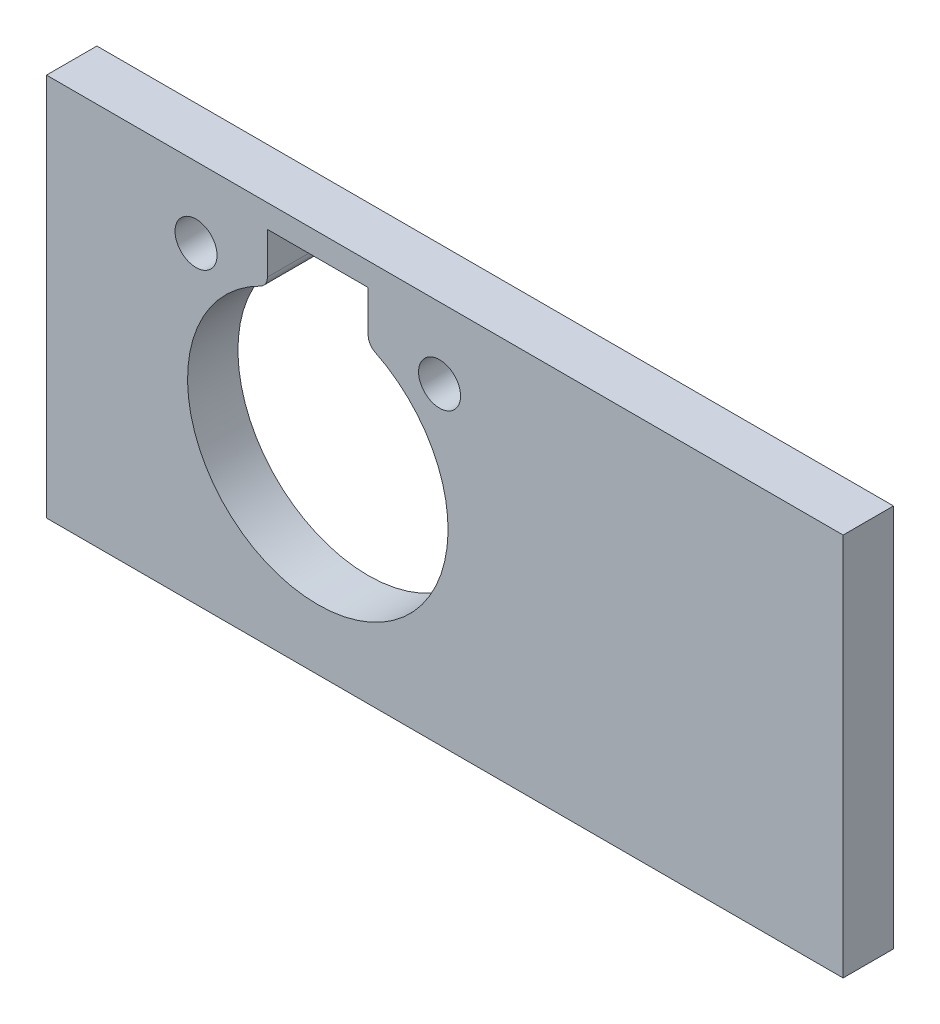
ISO-10303-21;
HEADER;
FILE_DESCRIPTION(('STEP AP214'),'2;1');
FILE_NAME('part.step','',(''),(''),'','','');
FILE_SCHEMA(('AUTOMOTIVE_DESIGN { 1 0 10303 214 1 1 1 1 }'));
ENDSEC;
DATA;
#1=APPLICATION_CONTEXT('core data for automotive mechanical design processes');
#2=APPLICATION_PROTOCOL_DEFINITION('international standard','automotive_design',2000,#1);
#3=PRODUCT_CONTEXT('',#1,'mechanical');
#4=PRODUCT('Part','Part','',(#3));
#5=PRODUCT_RELATED_PRODUCT_CATEGORY('part','',(#4));
#6=PRODUCT_DEFINITION_FORMATION('','',#4);
#7=PRODUCT_DEFINITION_CONTEXT('part definition',#1,'design');
#8=PRODUCT_DEFINITION('design','',#6,#7);
#9=PRODUCT_DEFINITION_SHAPE('','',#8);
#10=(LENGTH_UNIT() NAMED_UNIT(*) SI_UNIT(.MILLI.,.METRE.));
#11=(NAMED_UNIT(*) PLANE_ANGLE_UNIT() SI_UNIT($,.RADIAN.));
#12=(NAMED_UNIT(*) SI_UNIT($,.STERADIAN.) SOLID_ANGLE_UNIT());
#13=UNCERTAINTY_MEASURE_WITH_UNIT(LENGTH_MEASURE(1.E-05),#10,'distance_accuracy_value','');
#14=(GEOMETRIC_REPRESENTATION_CONTEXT(3) GLOBAL_UNCERTAINTY_ASSIGNED_CONTEXT((#13)) GLOBAL_UNIT_ASSIGNED_CONTEXT((#10,
#11,#12)) REPRESENTATION_CONTEXT('',''));
#15=CARTESIAN_POINT('',(0.,0.,0.));
#16=DIRECTION('',(0.,0.,1.));
#17=DIRECTION('',(1.,0.,0.));
#18=AXIS2_PLACEMENT_3D('',#15,#16,#17);
#19=CARTESIAN_POINT('',(24.6048030456819,16.0472978945954,3.));
#20=DIRECTION('',(-1.,0.,0.));
#21=DIRECTION('',(0.,-1.,0.));
#22=AXIS2_PLACEMENT_3D('',#19,#20,#21);
#23=PLANE('',#22);
#24=DIRECTION('',(0.,1.,0.));
#25=VECTOR('',#24,1.);
#26=CARTESIAN_POINT('',(24.6048030456819,16.0472978945954,0.));
#27=LINE('',#26,#25);
#28=CARTESIAN_POINT('',(24.6048030456819,-6.79270210540461,0.));
#29=VERTEX_POINT('',#28);
#30=CARTESIAN_POINT('',(24.6048030456819,16.0472978945954,0.));
#31=VERTEX_POINT('',#30);
#32=EDGE_CURVE('E164',#29,#31,#27,.T.);
#33=ORIENTED_EDGE('',*,*,#32,.T.);
#34=DIRECTION('',(0.,0.,-1.));
#35=VECTOR('',#34,1.);
#36=CARTESIAN_POINT('',(24.6048030456819,16.0472978945954,3.));
#37=LINE('',#36,#35);
#38=CARTESIAN_POINT('',(24.6048030456819,16.0472978945954,3.));
#39=VERTEX_POINT('',#38);
#40=EDGE_CURVE('E11',#39,#31,#37,.T.);
#41=ORIENTED_EDGE('',*,*,#40,.F.);
#42=DIRECTION('',(0.,1.,0.));
#43=VECTOR('',#42,1.);
#44=CARTESIAN_POINT('',(24.6048030456819,16.0472978945954,3.));
#45=LINE('',#44,#43);
#46=CARTESIAN_POINT('',(24.6048030456819,-6.79270210540461,3.));
#47=VERTEX_POINT('',#46);
#48=EDGE_CURVE('E165',#47,#39,#45,.T.);
#49=ORIENTED_EDGE('',*,*,#48,.F.);
#50=DIRECTION('',(0.,0.,-1.));
#51=VECTOR('',#50,1.);
#52=CARTESIAN_POINT('',(24.6048030456819,-6.79270210540461,3.));
#53=LINE('',#52,#51);
#54=EDGE_CURVE('E175',#47,#29,#53,.T.);
#55=ORIENTED_EDGE('',*,*,#54,.T.);
#56=EDGE_LOOP('',(#33,#41,#49,#55));
#57=FACE_BOUND('',#56,.T.);
#58=ADVANCED_FACE('F34',(#57),#23,.F.);
#59=CARTESIAN_POINT('',(24.6048030456819,16.0472978945954,3.));
#60=DIRECTION('',(0.,-1.,0.));
#61=DIRECTION('',(1.,0.,0.));
#62=AXIS2_PLACEMENT_3D('',#59,#60,#61);
#63=PLANE('',#62);
#64=DIRECTION('',(-1.,0.,0.));
#65=VECTOR('',#64,1.);
#66=CARTESIAN_POINT('',(24.6048030456819,16.0472978945954,0.));
#67=LINE('',#66,#65);
#68=CARTESIAN_POINT('',(-22.8242074927954,16.0472978945954,0.));
#69=VERTEX_POINT('',#68);
#70=EDGE_CURVE('E178',#31,#69,#67,.T.);
#71=ORIENTED_EDGE('',*,*,#70,.T.);
#72=DIRECTION('',(0.,0.,-1.));
#73=VECTOR('',#72,1.);
#74=CARTESIAN_POINT('',(-22.8242074927954,16.0472978945954,3.));
#75=LINE('',#74,#73);
#76=CARTESIAN_POINT('',(-22.8242074927954,16.0472978945954,3.));
#77=VERTEX_POINT('',#76);
#78=EDGE_CURVE('E41',#77,#69,#75,.T.);
#79=ORIENTED_EDGE('',*,*,#78,.F.);
#80=DIRECTION('',(-1.,0.,0.));
#81=VECTOR('',#80,1.);
#82=CARTESIAN_POINT('',(24.6048030456819,16.0472978945954,3.));
#83=LINE('',#82,#81);
#84=EDGE_CURVE('E168',#39,#77,#83,.T.);
#85=ORIENTED_EDGE('',*,*,#84,.F.);
#86=ORIENTED_EDGE('',*,*,#40,.T.);
#87=EDGE_LOOP('',(#71,#79,#85,#86));
#88=FACE_BOUND('',#87,.T.);
#89=ADVANCED_FACE('F207',(#88),#63,.F.);
#90=CARTESIAN_POINT('',(-22.8242074927954,16.0472978945954,3.));
#91=DIRECTION('',(1.,0.,0.));
#92=DIRECTION('',(0.,1.,0.));
#93=AXIS2_PLACEMENT_3D('',#90,#91,#92);
#94=PLANE('',#93);
#95=DIRECTION('',(0.,-1.,0.));
#96=VECTOR('',#95,1.);
#97=CARTESIAN_POINT('',(-22.8242074927954,16.0472978945954,0.));
#98=LINE('',#97,#96);
#99=CARTESIAN_POINT('',(-22.8242074927954,-6.79270210540462,0.));
#100=VERTEX_POINT('',#99);
#101=EDGE_CURVE('E180',#69,#100,#98,.T.);
#102=ORIENTED_EDGE('',*,*,#101,.T.);
#103=DIRECTION('',(0.,0.,-1.));
#104=VECTOR('',#103,1.);
#105=CARTESIAN_POINT('',(-22.8242074927954,-6.79270210540462,3.));
#106=LINE('',#105,#104);
#107=CARTESIAN_POINT('',(-22.8242074927954,-6.79270210540462,3.));
#108=VERTEX_POINT('',#107);
#109=EDGE_CURVE('E185',#108,#100,#106,.T.);
#110=ORIENTED_EDGE('',*,*,#109,.F.);
#111=DIRECTION('',(0.,-1.,0.));
#112=VECTOR('',#111,1.);
#113=CARTESIAN_POINT('',(-22.8242074927954,16.0472978945954,3.));
#114=LINE('',#113,#112);
#115=EDGE_CURVE('E171',#77,#108,#114,.T.);
#116=ORIENTED_EDGE('',*,*,#115,.F.);
#117=ORIENTED_EDGE('',*,*,#78,.T.);
#118=EDGE_LOOP('',(#102,#110,#116,#117));
#119=FACE_BOUND('',#118,.T.);
#120=ADVANCED_FACE('F192',(#119),#94,.F.);
#121=CARTESIAN_POINT('',(24.6048030456819,-6.79270210540461,3.));
#122=DIRECTION('',(0.,1.,0.));
#123=DIRECTION('',(-1.,0.,0.));
#124=AXIS2_PLACEMENT_3D('',#121,#122,#123);
#125=PLANE('',#124);
#126=DIRECTION('',(1.,0.,0.));
#127=VECTOR('',#126,1.);
#128=CARTESIAN_POINT('',(24.6048030456819,-6.79270210540461,0.));
#129=LINE('',#128,#127);
#130=EDGE_CURVE('E169',#100,#29,#129,.T.);
#131=ORIENTED_EDGE('',*,*,#130,.T.);
#132=ORIENTED_EDGE('',*,*,#54,.F.);
#133=DIRECTION('',(1.,0.,0.));
#134=VECTOR('',#133,1.);
#135=CARTESIAN_POINT('',(24.6048030456819,-6.79270210540461,3.));
#136=LINE('',#135,#134);
#137=EDGE_CURVE('E173',#108,#47,#136,.T.);
#138=ORIENTED_EDGE('',*,*,#137,.F.);
#139=ORIENTED_EDGE('',*,*,#109,.T.);
#140=EDGE_LOOP('',(#131,#132,#138,#139));
#141=FACE_BOUND('',#140,.T.);
#142=ADVANCED_FACE('F200',(#141),#125,.F.);
#143=CARTESIAN_POINT('',(0.,0.,3.));
#144=DIRECTION('',(0.,0.,-1.));
#145=DIRECTION('',(-1.,0.,0.));
#146=AXIS2_PLACEMENT_3D('',#143,#144,#145);
#147=PLANE('',#146);
#148=DIRECTION('',(-1.,0.,0.));
#149=VECTOR('',#148,1.);
#150=CARTESIAN_POINT('',(-3.67180383185212,14.6697978945954,3.));
#151=LINE('',#150,#149);
#152=CARTESIAN_POINT('',(-3.67180383185212,14.6697978945954,3.));
#153=VERTEX_POINT('',#152);
#154=CARTESIAN_POINT('',(-9.67078034036049,14.6697978945954,3.));
#155=VERTEX_POINT('',#154);
#156=EDGE_CURVE('E252',#153,#155,#151,.T.);
#157=ORIENTED_EDGE('',*,*,#156,.F.);
#158=DIRECTION('',(0.,1.,0.));
#159=VECTOR('',#158,1.);
#160=CARTESIAN_POINT('',(-3.67180383185212,14.6697978945954,3.));
#161=LINE('',#160,#159);
#162=CARTESIAN_POINT('',(-3.67180383185212,12.2086935469612,3.));
#163=VERTEX_POINT('',#162);
#164=EDGE_CURVE('E152',#163,#153,#161,.T.);
#165=ORIENTED_EDGE('',*,*,#164,.F.);
#166=CARTESIAN_POINT('',(-2.92180383185212,12.2086935469612,3.));
#167=DIRECTION('',(0.,0.,-1.));
#168=DIRECTION('',(-1.,0.,0.));
#169=AXIS2_PLACEMENT_3D('',#166,#167,#168);
#170=CIRCLE('',#169,0.75);
#171=CARTESIAN_POINT('',(-3.25244653504914,11.5355105088337,3.));
#172=VERTEX_POINT('',#171);
#173=EDGE_CURVE('E149',#172,#163,#170,.T.);
#174=ORIENTED_EDGE('',*,*,#173,.F.);
#175=CARTESIAN_POINT('',(-6.6712920861063,4.57479789459538,3.));
#176=DIRECTION('',(0.,0.,-1.));
#177=DIRECTION('',(-1.,0.,0.));
#178=AXIS2_PLACEMENT_3D('',#175,#176,#177);
#179=CIRCLE('',#178,7.755);
#180=CARTESIAN_POINT('',(-10.0901376371635,11.5355105088337,3.));
#181=VERTEX_POINT('',#180);
#182=EDGE_CURVE('E116',#181,#172,#179,.F.);
#183=ORIENTED_EDGE('',*,*,#182,.F.);
#184=CARTESIAN_POINT('',(-10.4207803403605,12.2086935469612,3.));
#185=DIRECTION('',(0.,0.,-1.));
#186=DIRECTION('',(-1.,0.,0.));
#187=AXIS2_PLACEMENT_3D('',#184,#185,#186);
#188=CIRCLE('',#187,0.749999999999999);
#189=CARTESIAN_POINT('',(-9.67078034036049,12.2086935469612,3.));
#190=VERTEX_POINT('',#189);
#191=EDGE_CURVE('E262',#190,#181,#188,.T.);
#192=ORIENTED_EDGE('',*,*,#191,.F.);
#193=DIRECTION('',(0.,-1.,0.));
#194=VECTOR('',#193,1.);
#195=CARTESIAN_POINT('',(-9.67078034036049,12.2086935469612,3.));
#196=LINE('',#195,#194);
#197=EDGE_CURVE('E256',#155,#190,#196,.T.);
#198=ORIENTED_EDGE('',*,*,#197,.F.);
#199=EDGE_LOOP('',(#157,#165,#174,#183,#192,#198));
#200=FACE_BOUND('',#199,.T.);
#201=CARTESIAN_POINT('',(-13.9212920861063,11.8247978945954,3.));
#202=DIRECTION('',(0.,0.,-1.));
#203=DIRECTION('',(-1.,0.,0.));
#204=AXIS2_PLACEMENT_3D('',#201,#202,#203);
#205=CIRCLE('',#204,1.25000000000045);
#206=CARTESIAN_POINT('',(-15.1712920861068,11.8247978945954,3.));
#207=VERTEX_POINT('',#206);
#208=EDGE_CURVE('E155',#207,#207,#205,.F.);
#209=ORIENTED_EDGE('',*,*,#208,.F.);
#210=EDGE_LOOP('',(#209));
#211=FACE_BOUND('',#210,.T.);
#212=CARTESIAN_POINT('',(0.578707913893695,11.8247978945954,3.));
#213=DIRECTION('',(0.,0.,-1.));
#214=DIRECTION('',(-1.,0.,0.));
#215=AXIS2_PLACEMENT_3D('',#212,#213,#214);
#216=CIRCLE('',#215,1.25000000000045);
#217=CARTESIAN_POINT('',(-0.671292086106753,11.8247978945954,3.));
#218=VERTEX_POINT('',#217);
#219=EDGE_CURVE('E161',#218,#218,#216,.F.);
#220=ORIENTED_EDGE('',*,*,#219,.F.);
#221=EDGE_LOOP('',(#220));
#222=FACE_BOUND('',#221,.T.);
#223=ORIENTED_EDGE('',*,*,#48,.T.);
#224=ORIENTED_EDGE('',*,*,#84,.T.);
#225=ORIENTED_EDGE('',*,*,#115,.T.);
#226=ORIENTED_EDGE('',*,*,#137,.T.);
#227=EDGE_LOOP('',(#223,#224,#225,#226));
#228=FACE_BOUND('',#227,.T.);
#229=ADVANCED_FACE('F206',(#200,#211,#222,#228),#147,.F.);
#230=CARTESIAN_POINT('',(0.,0.,0.));
#231=DIRECTION('',(0.,0.,-1.));
#232=DIRECTION('',(-1.,0.,0.));
#233=AXIS2_PLACEMENT_3D('',#230,#231,#232);
#234=PLANE('',#233);
#235=DIRECTION('',(0.,-1.,0.));
#236=VECTOR('',#235,1.);
#237=CARTESIAN_POINT('',(-3.67180383185212,14.6697978945954,0.));
#238=LINE('',#237,#236);
#239=CARTESIAN_POINT('',(-3.67180383185212,14.6697978945954,0.));
#240=VERTEX_POINT('',#239);
#241=CARTESIAN_POINT('',(-3.67180383185212,12.2086935469612,0.));
#242=VERTEX_POINT('',#241);
#243=EDGE_CURVE('E56',#240,#242,#238,.T.);
#244=ORIENTED_EDGE('',*,*,#243,.F.);
#245=DIRECTION('',(1.,0.,0.));
#246=VECTOR('',#245,1.);
#247=CARTESIAN_POINT('',(-3.67180383185212,14.6697978945954,0.));
#248=LINE('',#247,#246);
#249=CARTESIAN_POINT('',(-9.67078034036049,14.6697978945954,0.));
#250=VERTEX_POINT('',#249);
#251=EDGE_CURVE('E138',#250,#240,#248,.T.);
#252=ORIENTED_EDGE('',*,*,#251,.F.);
#253=DIRECTION('',(0.,1.,0.));
#254=VECTOR('',#253,1.);
#255=CARTESIAN_POINT('',(-9.67078034036049,12.2086935469612,0.));
#256=LINE('',#255,#254);
#257=CARTESIAN_POINT('',(-9.67078034036049,12.2086935469612,0.));
#258=VERTEX_POINT('',#257);
#259=EDGE_CURVE('E132',#258,#250,#256,.T.);
#260=ORIENTED_EDGE('',*,*,#259,.F.);
#261=CARTESIAN_POINT('',(-10.4207803403605,12.2086935469612,0.));
#262=DIRECTION('',(0.,0.,1.));
#263=DIRECTION('',(-1.,0.,0.));
#264=AXIS2_PLACEMENT_3D('',#261,#262,#263);
#265=CIRCLE('',#264,0.749999999999999);
#266=CARTESIAN_POINT('',(-10.0901376371635,11.5355105088337,0.));
#267=VERTEX_POINT('',#266);
#268=EDGE_CURVE('E130',#267,#258,#265,.T.);
#269=ORIENTED_EDGE('',*,*,#268,.F.);
#270=CARTESIAN_POINT('',(-6.6712920861063,4.57479789459538,0.));
#271=DIRECTION('',(0.,0.,-1.));
#272=DIRECTION('',(-1.,0.,0.));
#273=AXIS2_PLACEMENT_3D('',#270,#271,#272);
#274=CIRCLE('',#273,7.755);
#275=CARTESIAN_POINT('',(-3.25244653504914,11.5355105088337,0.));
#276=VERTEX_POINT('',#275);
#277=EDGE_CURVE('E113',#276,#267,#274,.T.);
#278=ORIENTED_EDGE('',*,*,#277,.F.);
#279=CARTESIAN_POINT('',(-2.92180383185212,12.2086935469612,0.));
#280=DIRECTION('',(0.,0.,1.));
#281=DIRECTION('',(-1.,0.,0.));
#282=AXIS2_PLACEMENT_3D('',#279,#280,#281);
#283=CIRCLE('',#282,0.75);
#284=EDGE_CURVE('E122',#242,#276,#283,.T.);
#285=ORIENTED_EDGE('',*,*,#284,.F.);
#286=EDGE_LOOP('',(#244,#252,#260,#269,#278,#285));
#287=FACE_BOUND('',#286,.T.);
#288=CARTESIAN_POINT('',(-13.9212920861063,11.8247978945954,0.));
#289=DIRECTION('',(0.,0.,-1.));
#290=DIRECTION('',(-1.,0.,0.));
#291=AXIS2_PLACEMENT_3D('',#288,#289,#290);
#292=CIRCLE('',#291,1.25000000000045);
#293=CARTESIAN_POINT('',(-15.1712920861068,11.8247978945954,0.));
#294=VERTEX_POINT('',#293);
#295=EDGE_CURVE('E151',#294,#294,#292,.T.);
#296=ORIENTED_EDGE('',*,*,#295,.F.);
#297=EDGE_LOOP('',(#296));
#298=FACE_BOUND('',#297,.T.);
#299=CARTESIAN_POINT('',(0.578707913893695,11.8247978945954,0.));
#300=DIRECTION('',(0.,0.,-1.));
#301=DIRECTION('',(-1.,0.,0.));
#302=AXIS2_PLACEMENT_3D('',#299,#300,#301);
#303=CIRCLE('',#302,1.25000000000045);
#304=CARTESIAN_POINT('',(-0.671292086106753,11.8247978945954,0.));
#305=VERTEX_POINT('',#304);
#306=EDGE_CURVE('E158',#305,#305,#303,.T.);
#307=ORIENTED_EDGE('',*,*,#306,.F.);
#308=EDGE_LOOP('',(#307));
#309=FACE_BOUND('',#308,.T.);
#310=ORIENTED_EDGE('',*,*,#32,.F.);
#311=ORIENTED_EDGE('',*,*,#130,.F.);
#312=ORIENTED_EDGE('',*,*,#101,.F.);
#313=ORIENTED_EDGE('',*,*,#70,.F.);
#314=EDGE_LOOP('',(#310,#311,#312,#313));
#315=FACE_BOUND('',#314,.T.);
#316=ADVANCED_FACE('F126',(#287,#298,#309,#315),#234,.T.);
#317=CARTESIAN_POINT('',(0.578707913893695,11.8247978945954,26.647042098326));
#318=DIRECTION('',(0.,0.,-1.));
#319=DIRECTION('',(-1.,0.,0.));
#320=AXIS2_PLACEMENT_3D('',#317,#318,#319);
#321=CYLINDRICAL_SURFACE('',#320,1.25000000000045);
#322=ORIENTED_EDGE('',*,*,#219,.T.);
#323=EDGE_LOOP('',(#322));
#324=FACE_BOUND('',#323,.T.);
#325=ORIENTED_EDGE('',*,*,#306,.T.);
#326=EDGE_LOOP('',(#325));
#327=FACE_BOUND('',#326,.T.);
#328=ADVANCED_FACE('F219',(#324,#327),#321,.F.);
#329=CARTESIAN_POINT('',(-13.9212920861063,11.8247978945954,26.647042098326));
#330=DIRECTION('',(0.,0.,-1.));
#331=DIRECTION('',(-1.,0.,0.));
#332=AXIS2_PLACEMENT_3D('',#329,#330,#331);
#333=CYLINDRICAL_SURFACE('',#332,1.25000000000045);
#334=ORIENTED_EDGE('',*,*,#208,.T.);
#335=EDGE_LOOP('',(#334));
#336=FACE_BOUND('',#335,.T.);
#337=ORIENTED_EDGE('',*,*,#295,.T.);
#338=EDGE_LOOP('',(#337));
#339=FACE_BOUND('',#338,.T.);
#340=ADVANCED_FACE('F225',(#336,#339),#333,.F.);
#341=CARTESIAN_POINT('',(-3.67180383185212,14.6697978945954,26.647042098326));
#342=DIRECTION('',(1.,0.,0.));
#343=DIRECTION('',(0.,0.,-1.));
#344=AXIS2_PLACEMENT_3D('',#341,#342,#343);
#345=PLANE('',#344);
#346=ORIENTED_EDGE('',*,*,#164,.T.);
#347=DIRECTION('',(0.,0.,-1.));
#348=VECTOR('',#347,1.);
#349=CARTESIAN_POINT('',(-3.67180383185212,14.6697978945954,26.647042098326));
#350=LINE('',#349,#348);
#351=EDGE_CURVE('E141',#153,#240,#350,.T.);
#352=ORIENTED_EDGE('',*,*,#351,.T.);
#353=ORIENTED_EDGE('',*,*,#243,.T.);
#354=DIRECTION('',(0.,0.,-1.));
#355=VECTOR('',#354,1.);
#356=CARTESIAN_POINT('',(-3.67180383185212,12.2086935469612,26.647042098326));
#357=LINE('',#356,#355);
#358=EDGE_CURVE('E119',#163,#242,#357,.T.);
#359=ORIENTED_EDGE('',*,*,#358,.F.);
#360=EDGE_LOOP('',(#346,#352,#353,#359));
#361=FACE_BOUND('',#360,.T.);
#362=ADVANCED_FACE('F229',(#361),#345,.F.);
#363=CARTESIAN_POINT('',(-3.67180383185212,14.6697978945954,26.647042098326));
#364=DIRECTION('',(0.,1.,0.));
#365=DIRECTION('',(0.,0.,1.));
#366=AXIS2_PLACEMENT_3D('',#363,#364,#365);
#367=PLANE('',#366);
#368=ORIENTED_EDGE('',*,*,#156,.T.);
#369=DIRECTION('',(0.,0.,-1.));
#370=VECTOR('',#369,1.);
#371=CARTESIAN_POINT('',(-9.67078034036049,14.6697978945954,26.647042098326));
#372=LINE('',#371,#370);
#373=EDGE_CURVE('E143',#155,#250,#372,.T.);
#374=ORIENTED_EDGE('',*,*,#373,.T.);
#375=ORIENTED_EDGE('',*,*,#251,.T.);
#376=ORIENTED_EDGE('',*,*,#351,.F.);
#377=EDGE_LOOP('',(#368,#374,#375,#376));
#378=FACE_BOUND('',#377,.T.);
#379=ADVANCED_FACE('F233',(#378),#367,.F.);
#380=CARTESIAN_POINT('',(-9.67078034036049,12.2086935469612,26.647042098326));
#381=DIRECTION('',(-1.,0.,0.));
#382=DIRECTION('',(0.,0.,1.));
#383=AXIS2_PLACEMENT_3D('',#380,#381,#382);
#384=PLANE('',#383);
#385=ORIENTED_EDGE('',*,*,#197,.T.);
#386=DIRECTION('',(0.,0.,-1.));
#387=VECTOR('',#386,1.);
#388=CARTESIAN_POINT('',(-9.67078034036049,12.2086935469612,26.647042098326));
#389=LINE('',#388,#387);
#390=EDGE_CURVE('E145',#190,#258,#389,.T.);
#391=ORIENTED_EDGE('',*,*,#390,.T.);
#392=ORIENTED_EDGE('',*,*,#259,.T.);
#393=ORIENTED_EDGE('',*,*,#373,.F.);
#394=EDGE_LOOP('',(#385,#391,#392,#393));
#395=FACE_BOUND('',#394,.T.);
#396=ADVANCED_FACE('F241',(#395),#384,.F.);
#397=CARTESIAN_POINT('',(-10.4207803403605,12.2086935469612,26.647042098326));
#398=DIRECTION('',(0.,0.,-1.));
#399=DIRECTION('',(-1.,0.,0.));
#400=AXIS2_PLACEMENT_3D('',#397,#398,#399);
#401=CYLINDRICAL_SURFACE('',#400,0.749999999999999);
#402=ORIENTED_EDGE('',*,*,#191,.T.);
#403=DIRECTION('',(0.,0.,-1.));
#404=VECTOR('',#403,1.);
#405=CARTESIAN_POINT('',(-10.0901376371635,11.5355105088337,26.647042098326));
#406=LINE('',#405,#404);
#407=EDGE_CURVE('E118',#181,#267,#406,.T.);
#408=ORIENTED_EDGE('',*,*,#407,.T.);
#409=ORIENTED_EDGE('',*,*,#268,.T.);
#410=ORIENTED_EDGE('',*,*,#390,.F.);
#411=EDGE_LOOP('',(#402,#408,#409,#410));
#412=FACE_BOUND('',#411,.T.);
#413=ADVANCED_FACE('F238',(#412),#401,.T.);
#414=CARTESIAN_POINT('',(-6.6712920861063,4.57479789459538,26.647042098326));
#415=DIRECTION('',(0.,0.,-1.));
#416=DIRECTION('',(-1.,0.,0.));
#417=AXIS2_PLACEMENT_3D('',#414,#415,#416);
#418=CYLINDRICAL_SURFACE('',#417,7.755);
#419=ORIENTED_EDGE('',*,*,#182,.T.);
#420=DIRECTION('',(0.,0.,-1.));
#421=VECTOR('',#420,1.);
#422=CARTESIAN_POINT('',(-3.25244653504914,11.5355105088337,26.647042098326));
#423=LINE('',#422,#421);
#424=EDGE_CURVE('E48',#172,#276,#423,.T.);
#425=ORIENTED_EDGE('',*,*,#424,.T.);
#426=ORIENTED_EDGE('',*,*,#277,.T.);
#427=ORIENTED_EDGE('',*,*,#407,.F.);
#428=EDGE_LOOP('',(#419,#425,#426,#427));
#429=FACE_BOUND('',#428,.T.);
#430=ADVANCED_FACE('F110',(#429),#418,.F.);
#431=CARTESIAN_POINT('',(-2.92180383185212,12.2086935469612,26.647042098326));
#432=DIRECTION('',(0.,0.,-1.));
#433=DIRECTION('',(-1.,0.,0.));
#434=AXIS2_PLACEMENT_3D('',#431,#432,#433);
#435=CYLINDRICAL_SURFACE('',#434,0.75);
#436=ORIENTED_EDGE('',*,*,#173,.T.);
#437=ORIENTED_EDGE('',*,*,#358,.T.);
#438=ORIENTED_EDGE('',*,*,#284,.T.);
#439=ORIENTED_EDGE('',*,*,#424,.F.);
#440=EDGE_LOOP('',(#436,#437,#438,#439));
#441=FACE_BOUND('',#440,.T.);
#442=ADVANCED_FACE('F123',(#441),#435,.T.);
#443=CLOSED_SHELL('',(#58,#89,#120,#142,#229,#316,#328,#340,#362,#379,#396,#413,#430,#442));
#444=MANIFOLD_SOLID_BREP('B2',#443);
#445=ADVANCED_BREP_SHAPE_REPRESENTATION('',(#18,#444),#14);
#446=SHAPE_DEFINITION_REPRESENTATION(#9,#445);
ENDSEC;
END-ISO-10303-21;
